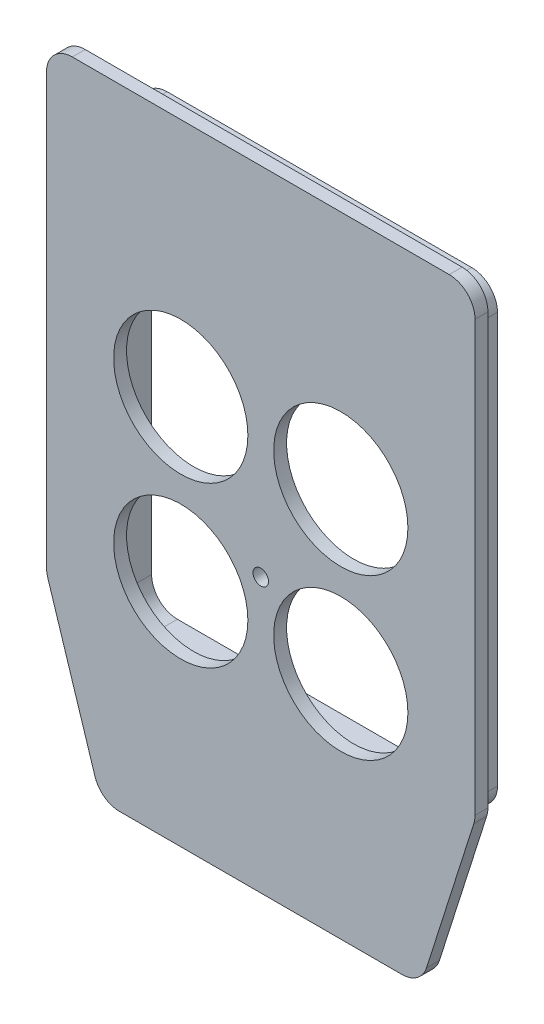
ISO-10303-21;
HEADER;
FILE_DESCRIPTION(('STEP AP214'),'2;1');
FILE_NAME('part.step','',(''),(''),'','','');
FILE_SCHEMA(('AUTOMOTIVE_DESIGN { 1 0 10303 214 1 1 1 1 }'));
ENDSEC;
DATA;
#1=APPLICATION_CONTEXT('core data for automotive mechanical design processes');
#2=APPLICATION_PROTOCOL_DEFINITION('international standard','automotive_design',2000,#1);
#3=PRODUCT_CONTEXT('',#1,'mechanical');
#4=PRODUCT('Part','Part','',(#3));
#5=PRODUCT_RELATED_PRODUCT_CATEGORY('part','',(#4));
#6=PRODUCT_DEFINITION_FORMATION('','',#4);
#7=PRODUCT_DEFINITION_CONTEXT('part definition',#1,'design');
#8=PRODUCT_DEFINITION('design','',#6,#7);
#9=PRODUCT_DEFINITION_SHAPE('','',#8);
#10=(LENGTH_UNIT() NAMED_UNIT(*) SI_UNIT(.MILLI.,.METRE.));
#11=(NAMED_UNIT(*) PLANE_ANGLE_UNIT() SI_UNIT($,.RADIAN.));
#12=(NAMED_UNIT(*) SI_UNIT($,.STERADIAN.) SOLID_ANGLE_UNIT());
#13=UNCERTAINTY_MEASURE_WITH_UNIT(LENGTH_MEASURE(1.E-05),#10,'distance_accuracy_value','');
#14=(GEOMETRIC_REPRESENTATION_CONTEXT(3) GLOBAL_UNCERTAINTY_ASSIGNED_CONTEXT((#13)) GLOBAL_UNIT_ASSIGNED_CONTEXT((#10,
#11,#12)) REPRESENTATION_CONTEXT('',''));
#15=CARTESIAN_POINT('',(0.,0.,0.));
#16=DIRECTION('',(0.,0.,1.));
#17=DIRECTION('',(1.,0.,0.));
#18=AXIS2_PLACEMENT_3D('',#15,#16,#17);
#19=CARTESIAN_POINT('',(0.,0.,0.));
#20=DIRECTION('',(0.,0.,-1.));
#21=DIRECTION('',(-1.,0.,0.));
#22=AXIS2_PLACEMENT_3D('',#19,#20,#21);
#23=PLANE('',#22);
#24=DIRECTION('',(-1.,0.,0.));
#25=VECTOR('',#24,1.);
#26=CARTESIAN_POINT('',(0.,81.,0.));
#27=LINE('',#26,#25);
#28=CARTESIAN_POINT('',(71.,81.,0.));
#29=VERTEX_POINT('',#28);
#30=CARTESIAN_POINT('',(12.,81.,0.));
#31=VERTEX_POINT('',#30);
#32=EDGE_CURVE('E562',#29,#31,#27,.T.);
#33=ORIENTED_EDGE('',*,*,#32,.T.);
#34=CARTESIAN_POINT('',(12.,76.,0.));
#35=DIRECTION('',(0.,0.,-1.));
#36=DIRECTION('',(-1.,0.,0.));
#37=AXIS2_PLACEMENT_3D('',#34,#35,#36);
#38=CIRCLE('',#37,5.);
#39=CARTESIAN_POINT('',(7.00000000000002,76.,0.));
#40=VERTEX_POINT('',#39);
#41=EDGE_CURVE('E376',#31,#40,#38,.F.);
#42=ORIENTED_EDGE('',*,*,#41,.T.);
#43=DIRECTION('',(0.,-1.,0.));
#44=VECTOR('',#43,1.);
#45=CARTESIAN_POINT('',(7.00000000000001,0.,0.));
#46=LINE('',#45,#44);
#47=CARTESIAN_POINT('',(7.00000000000001,-3.5,0.));
#48=VERTEX_POINT('',#47);
#49=EDGE_CURVE('E559',#40,#48,#46,.T.);
#50=ORIENTED_EDGE('',*,*,#49,.T.);
#51=CARTESIAN_POINT('',(12.,-3.5,0.));
#52=DIRECTION('',(0.,0.,-1.));
#53=DIRECTION('',(-1.,0.,0.));
#54=AXIS2_PLACEMENT_3D('',#51,#52,#53);
#55=CIRCLE('',#54,5.);
#56=CARTESIAN_POINT('',(12.,-8.5,0.));
#57=VERTEX_POINT('',#56);
#58=EDGE_CURVE('E366',#48,#57,#55,.F.);
#59=ORIENTED_EDGE('',*,*,#58,.T.);
#60=DIRECTION('',(-1.,0.,0.));
#61=VECTOR('',#60,1.);
#62=CARTESIAN_POINT('',(0.,-8.5,0.));
#63=LINE('',#62,#61);
#64=CARTESIAN_POINT('',(71.,-8.5,0.));
#65=VERTEX_POINT('',#64);
#66=EDGE_CURVE('E567',#65,#57,#63,.T.);
#67=ORIENTED_EDGE('',*,*,#66,.F.);
#68=CARTESIAN_POINT('',(71.,-3.5,0.));
#69=DIRECTION('',(0.,0.,-1.));
#70=DIRECTION('',(-1.,0.,0.));
#71=AXIS2_PLACEMENT_3D('',#68,#69,#70);
#72=CIRCLE('',#71,5.);
#73=CARTESIAN_POINT('',(76.,-3.5,0.));
#74=VERTEX_POINT('',#73);
#75=EDGE_CURVE('E368',#65,#74,#72,.F.);
#76=ORIENTED_EDGE('',*,*,#75,.T.);
#77=DIRECTION('',(0.,-1.,0.));
#78=VECTOR('',#77,1.);
#79=CARTESIAN_POINT('',(76.,0.,0.));
#80=LINE('',#79,#78);
#81=CARTESIAN_POINT('',(76.,76.,0.));
#82=VERTEX_POINT('',#81);
#83=EDGE_CURVE('E564',#82,#74,#80,.T.);
#84=ORIENTED_EDGE('',*,*,#83,.F.);
#85=CARTESIAN_POINT('',(71.,76.,0.));
#86=DIRECTION('',(0.,0.,-1.));
#87=DIRECTION('',(-1.,0.,0.));
#88=AXIS2_PLACEMENT_3D('',#85,#86,#87);
#89=CIRCLE('',#88,5.);
#90=EDGE_CURVE('E11',#82,#29,#89,.F.);
#91=ORIENTED_EDGE('',*,*,#90,.T.);
#92=EDGE_LOOP('',(#33,#42,#50,#59,#67,#76,#84,#91));
#93=FACE_BOUND('',#92,.T.);
#94=DIRECTION('',(0.,-1.,0.));
#95=VECTOR('',#94,1.);
#96=CARTESIAN_POINT('',(0.,0.,0.));
#97=LINE('',#96,#95);
#98=CARTESIAN_POINT('',(0.,84.,0.));
#99=VERTEX_POINT('',#98);
#100=CARTESIAN_POINT('',(0.,0.776280543735993,0.));
#101=VERTEX_POINT('',#100);
#102=EDGE_CURVE('E238',#99,#101,#97,.T.);
#103=ORIENTED_EDGE('',*,*,#102,.F.);
#104=CARTESIAN_POINT('',(4.99999999999999,84.,0.));
#105=DIRECTION('',(0.,0.,-1.));
#106=DIRECTION('',(-1.,0.,0.));
#107=AXIS2_PLACEMENT_3D('',#104,#105,#106);
#108=CIRCLE('',#107,5.);
#109=CARTESIAN_POINT('',(4.99999999999999,89.,0.));
#110=VERTEX_POINT('',#109);
#111=EDGE_CURVE('E221',#99,#110,#108,.T.);
#112=ORIENTED_EDGE('',*,*,#111,.T.);
#113=DIRECTION('',(-1.,0.,0.));
#114=VECTOR('',#113,1.);
#115=CARTESIAN_POINT('',(0.,89.,0.));
#116=LINE('',#115,#114);
#117=CARTESIAN_POINT('',(78.,89.,0.));
#118=VERTEX_POINT('',#117);
#119=EDGE_CURVE('E267',#118,#110,#116,.T.);
#120=ORIENTED_EDGE('',*,*,#119,.F.);
#121=CARTESIAN_POINT('',(78.,84.,0.));
#122=DIRECTION('',(0.,0.,-1.));
#123=DIRECTION('',(-1.,0.,0.));
#124=AXIS2_PLACEMENT_3D('',#121,#122,#123);
#125=CIRCLE('',#124,5.);
#126=CARTESIAN_POINT('',(83.,84.,0.));
#127=VERTEX_POINT('',#126);
#128=EDGE_CURVE('E232',#118,#127,#125,.T.);
#129=ORIENTED_EDGE('',*,*,#128,.T.);
#130=DIRECTION('',(0.,1.,0.));
#131=VECTOR('',#130,1.);
#132=CARTESIAN_POINT('',(83.,0.,0.));
#133=LINE('',#132,#131);
#134=CARTESIAN_POINT('',(83.,0.776280543735969,0.));
#135=VERTEX_POINT('',#134);
#136=EDGE_CURVE('E264',#135,#127,#133,.T.);
#137=ORIENTED_EDGE('',*,*,#136,.F.);
#138=CARTESIAN_POINT('',(78.,0.776280543735968,0.));
#139=DIRECTION('',(0.,0.,-1.));
#140=DIRECTION('',(-1.,0.,0.));
#141=AXIS2_PLACEMENT_3D('',#138,#139,#140);
#142=CIRCLE('',#141,5.);
#143=CARTESIAN_POINT('',(82.7646289000663,-0.739737742648773,0.));
#144=VERTEX_POINT('',#143);
#145=EDGE_CURVE('E275',#135,#144,#142,.T.);
#146=ORIENTED_EDGE('',*,*,#145,.T.);
#147=DIRECTION('',(0.303203657276947,0.952925780013262,0.));
#148=VECTOR('',#147,1.);
#149=CARTESIAN_POINT('',(72.5,-33.,0.));
#150=LINE('',#149,#148);
#151=CARTESIAN_POINT('',(73.6085396361503,-29.5160182863847,0.));
#152=VERTEX_POINT('',#151);
#153=EDGE_CURVE('E261',#152,#144,#150,.T.);
#154=ORIENTED_EDGE('',*,*,#153,.F.);
#155=CARTESIAN_POINT('',(68.843910736084,-28.,0.));
#156=DIRECTION('',(0.,0.,-1.));
#157=DIRECTION('',(-1.,0.,0.));
#158=AXIS2_PLACEMENT_3D('',#155,#156,#157);
#159=CIRCLE('',#158,5.);
#160=CARTESIAN_POINT('',(68.843910736084,-33.,0.));
#161=VERTEX_POINT('',#160);
#162=EDGE_CURVE('E273',#152,#161,#159,.T.);
#163=ORIENTED_EDGE('',*,*,#162,.T.);
#164=DIRECTION('',(1.,0.,0.));
#165=VECTOR('',#164,1.);
#166=CARTESIAN_POINT('',(10.5,-33.,0.));
#167=LINE('',#166,#165);
#168=CARTESIAN_POINT('',(14.156089263916,-33.,0.));
#169=VERTEX_POINT('',#168);
#170=EDGE_CURVE('E250',#169,#161,#167,.T.);
#171=ORIENTED_EDGE('',*,*,#170,.F.);
#172=CARTESIAN_POINT('',(14.156089263916,-28.,0.));
#173=DIRECTION('',(0.,0.,-1.));
#174=DIRECTION('',(-1.,0.,0.));
#175=AXIS2_PLACEMENT_3D('',#172,#173,#174);
#176=CIRCLE('',#175,5.);
#177=CARTESIAN_POINT('',(9.39146036384969,-29.5160182863847,0.));
#178=VERTEX_POINT('',#177);
#179=EDGE_CURVE('E271',#169,#178,#176,.T.);
#180=ORIENTED_EDGE('',*,*,#179,.T.);
#181=DIRECTION('',(0.303203657276947,-0.952925780013262,0.));
#182=VECTOR('',#181,1.);
#183=CARTESIAN_POINT('',(0.,0.,0.));
#184=LINE('',#183,#182);
#185=CARTESIAN_POINT('',(0.23537109993369,-0.739737742648741,0.));
#186=VERTEX_POINT('',#185);
#187=EDGE_CURVE('E246',#186,#178,#184,.T.);
#188=ORIENTED_EDGE('',*,*,#187,.F.);
#189=CARTESIAN_POINT('',(5.,0.776280543735994,0.));
#190=DIRECTION('',(0.,0.,-1.));
#191=DIRECTION('',(-1.,0.,0.));
#192=AXIS2_PLACEMENT_3D('',#189,#190,#191);
#193=CIRCLE('',#192,5.);
#194=EDGE_CURVE('E242',#186,#101,#193,.T.);
#195=ORIENTED_EDGE('',*,*,#194,.T.);
#196=EDGE_LOOP('',(#103,#112,#120,#129,#137,#146,#154,#163,#171,#180,#188,#195));
#197=FACE_BOUND('',#196,.T.);
#198=ADVANCED_FACE('F35',(#93,#197),#23,.T.);
#199=CARTESIAN_POINT('',(0.,0.,2.5));
#200=DIRECTION('',(0.,0.,-1.));
#201=DIRECTION('',(-1.,0.,0.));
#202=AXIS2_PLACEMENT_3D('',#199,#200,#201);
#203=PLANE('',#202);
#204=DIRECTION('',(-1.,0.,0.));
#205=VECTOR('',#204,1.);
#206=CARTESIAN_POINT('',(0.,89.,2.5));
#207=LINE('',#206,#205);
#208=CARTESIAN_POINT('',(78.,89.,2.5));
#209=VERTEX_POINT('',#208);
#210=CARTESIAN_POINT('',(4.99999999999999,89.,2.5));
#211=VERTEX_POINT('',#210);
#212=EDGE_CURVE('E256',#209,#211,#207,.T.);
#213=ORIENTED_EDGE('',*,*,#212,.T.);
#214=CARTESIAN_POINT('',(4.99999999999999,84.,2.5));
#215=DIRECTION('',(0.,0.,-1.));
#216=DIRECTION('',(-1.,0.,0.));
#217=AXIS2_PLACEMENT_3D('',#214,#215,#216);
#218=CIRCLE('',#217,5.);
#219=CARTESIAN_POINT('',(0.,84.,2.5));
#220=VERTEX_POINT('',#219);
#221=EDGE_CURVE('E291',#211,#220,#218,.F.);
#222=ORIENTED_EDGE('',*,*,#221,.T.);
#223=DIRECTION('',(0.,-1.,0.));
#224=VECTOR('',#223,1.);
#225=CARTESIAN_POINT('',(0.,0.,2.5));
#226=LINE('',#225,#224);
#227=CARTESIAN_POINT('',(0.,0.776280543735993,2.5));
#228=VERTEX_POINT('',#227);
#229=EDGE_CURVE('E241',#220,#228,#226,.T.);
#230=ORIENTED_EDGE('',*,*,#229,.T.);
#231=CARTESIAN_POINT('',(5.,0.776280543735994,2.5));
#232=DIRECTION('',(0.,0.,-1.));
#233=DIRECTION('',(-1.,0.,0.));
#234=AXIS2_PLACEMENT_3D('',#231,#232,#233);
#235=CIRCLE('',#234,5.);
#236=CARTESIAN_POINT('',(0.23537109993369,-0.739737742648741,2.5));
#237=VERTEX_POINT('',#236);
#238=EDGE_CURVE('E281',#228,#237,#235,.F.);
#239=ORIENTED_EDGE('',*,*,#238,.T.);
#240=DIRECTION('',(0.303203657276947,-0.952925780013262,0.));
#241=VECTOR('',#240,1.);
#242=CARTESIAN_POINT('',(0.,0.,2.5));
#243=LINE('',#242,#241);
#244=CARTESIAN_POINT('',(9.39146036384969,-29.5160182863847,2.5));
#245=VERTEX_POINT('',#244);
#246=EDGE_CURVE('E467',#237,#245,#243,.T.);
#247=ORIENTED_EDGE('',*,*,#246,.T.);
#248=CARTESIAN_POINT('',(14.156089263916,-28.,2.5));
#249=DIRECTION('',(0.,0.,-1.));
#250=DIRECTION('',(-1.,0.,0.));
#251=AXIS2_PLACEMENT_3D('',#248,#249,#250);
#252=CIRCLE('',#251,5.);
#253=CARTESIAN_POINT('',(14.156089263916,-33.,2.5));
#254=VERTEX_POINT('',#253);
#255=EDGE_CURVE('E283',#245,#254,#252,.F.);
#256=ORIENTED_EDGE('',*,*,#255,.T.);
#257=DIRECTION('',(1.,0.,0.));
#258=VECTOR('',#257,1.);
#259=CARTESIAN_POINT('',(10.5,-33.,2.5));
#260=LINE('',#259,#258);
#261=CARTESIAN_POINT('',(68.843910736084,-33.,2.5));
#262=VERTEX_POINT('',#261);
#263=EDGE_CURVE('E470',#254,#262,#260,.T.);
#264=ORIENTED_EDGE('',*,*,#263,.T.);
#265=CARTESIAN_POINT('',(68.843910736084,-28.,2.5));
#266=DIRECTION('',(0.,0.,-1.));
#267=DIRECTION('',(-1.,0.,0.));
#268=AXIS2_PLACEMENT_3D('',#265,#266,#267);
#269=CIRCLE('',#268,5.);
#270=CARTESIAN_POINT('',(73.6085396361503,-29.5160182863847,2.5));
#271=VERTEX_POINT('',#270);
#272=EDGE_CURVE('E285',#262,#271,#269,.F.);
#273=ORIENTED_EDGE('',*,*,#272,.T.);
#274=DIRECTION('',(0.303203657276947,0.952925780013262,0.));
#275=VECTOR('',#274,1.);
#276=CARTESIAN_POINT('',(72.5,-33.,2.5));
#277=LINE('',#276,#275);
#278=CARTESIAN_POINT('',(82.7646289000663,-0.739737742648773,2.5));
#279=VERTEX_POINT('',#278);
#280=EDGE_CURVE('E473',#271,#279,#277,.T.);
#281=ORIENTED_EDGE('',*,*,#280,.T.);
#282=CARTESIAN_POINT('',(78.,0.776280543735968,2.5));
#283=DIRECTION('',(0.,0.,-1.));
#284=DIRECTION('',(-1.,0.,0.));
#285=AXIS2_PLACEMENT_3D('',#282,#283,#284);
#286=CIRCLE('',#285,5.);
#287=CARTESIAN_POINT('',(83.,0.776280543735969,2.5));
#288=VERTEX_POINT('',#287);
#289=EDGE_CURVE('E287',#279,#288,#286,.F.);
#290=ORIENTED_EDGE('',*,*,#289,.T.);
#291=DIRECTION('',(0.,1.,0.));
#292=VECTOR('',#291,1.);
#293=CARTESIAN_POINT('',(83.,0.,2.5));
#294=LINE('',#293,#292);
#295=CARTESIAN_POINT('',(83.,84.,2.5));
#296=VERTEX_POINT('',#295);
#297=EDGE_CURVE('E475',#288,#296,#294,.T.);
#298=ORIENTED_EDGE('',*,*,#297,.T.);
#299=CARTESIAN_POINT('',(78.,84.,2.5));
#300=DIRECTION('',(0.,0.,-1.));
#301=DIRECTION('',(-1.,0.,0.));
#302=AXIS2_PLACEMENT_3D('',#299,#300,#301);
#303=CIRCLE('',#302,5.);
#304=EDGE_CURVE('E289',#296,#209,#303,.F.);
#305=ORIENTED_EDGE('',*,*,#304,.T.);
#306=EDGE_LOOP('',(#213,#222,#230,#239,#247,#256,#264,#273,#281,#290,#298,#305));
#307=FACE_BOUND('',#306,.T.);
#308=CARTESIAN_POINT('',(57.,42.5,2.5));
#309=DIRECTION('',(0.,0.,1.));
#310=DIRECTION('',(1.,0.,0.));
#311=AXIS2_PLACEMENT_3D('',#308,#309,#310);
#312=CIRCLE('',#311,13.);
#313=CARTESIAN_POINT('',(70.,42.5,2.5));
#314=VERTEX_POINT('',#313);
#315=EDGE_CURVE('E247',#314,#314,#312,.T.);
#316=ORIENTED_EDGE('',*,*,#315,.F.);
#317=EDGE_LOOP('',(#316));
#318=FACE_BOUND('',#317,.T.);
#319=CARTESIAN_POINT('',(26.,11.5,2.5));
#320=DIRECTION('',(0.,0.,1.));
#321=DIRECTION('',(1.,0.,0.));
#322=AXIS2_PLACEMENT_3D('',#319,#320,#321);
#323=CIRCLE('',#322,13.);
#324=CARTESIAN_POINT('',(39.,11.5,2.5));
#325=VERTEX_POINT('',#324);
#326=EDGE_CURVE('E461',#325,#325,#323,.T.);
#327=ORIENTED_EDGE('',*,*,#326,.F.);
#328=EDGE_LOOP('',(#327));
#329=FACE_BOUND('',#328,.T.);
#330=CARTESIAN_POINT('',(26.,42.5,2.5));
#331=DIRECTION('',(0.,0.,1.));
#332=DIRECTION('',(1.,0.,0.));
#333=AXIS2_PLACEMENT_3D('',#330,#331,#332);
#334=CIRCLE('',#333,13.);
#335=CARTESIAN_POINT('',(39.,42.5,2.5));
#336=VERTEX_POINT('',#335);
#337=EDGE_CURVE('E457',#336,#336,#334,.T.);
#338=ORIENTED_EDGE('',*,*,#337,.F.);
#339=EDGE_LOOP('',(#338));
#340=FACE_BOUND('',#339,.T.);
#341=CARTESIAN_POINT('',(57.,11.5,2.5));
#342=DIRECTION('',(0.,0.,1.));
#343=DIRECTION('',(1.,0.,0.));
#344=AXIS2_PLACEMENT_3D('',#341,#342,#343);
#345=CIRCLE('',#344,13.);
#346=CARTESIAN_POINT('',(70.,11.5,2.5));
#347=VERTEX_POINT('',#346);
#348=EDGE_CURVE('E453',#347,#347,#345,.T.);
#349=ORIENTED_EDGE('',*,*,#348,.F.);
#350=EDGE_LOOP('',(#349));
#351=FACE_BOUND('',#350,.T.);
#352=CARTESIAN_POINT('',(41.5,19.99,2.5));
#353=DIRECTION('',(0.,0.,1.));
#354=DIRECTION('',(1.,0.,0.));
#355=AXIS2_PLACEMENT_3D('',#352,#353,#354);
#356=CIRCLE('',#355,1.5);
#357=CARTESIAN_POINT('',(43.,19.99,2.5));
#358=VERTEX_POINT('',#357);
#359=EDGE_CURVE('E444',#358,#358,#356,.T.);
#360=ORIENTED_EDGE('',*,*,#359,.F.);
#361=EDGE_LOOP('',(#360));
#362=FACE_BOUND('',#361,.T.);
#363=ADVANCED_FACE('F404',(#307,#318,#329,#340,#351,#362),#203,.F.);
#364=DIRECTION('',(0.,-1.,0.));
#365=VECTOR('',#364,1.);
#366=CARTESIAN_POINT('',(74.,0.,0.));
#367=LINE('',#366,#365);
#368=CARTESIAN_POINT('',(74.,74.,0.));
#369=VERTEX_POINT('',#368);
#370=CARTESIAN_POINT('',(74.,-1.5,0.));
#371=VERTEX_POINT('',#370);
#372=EDGE_CURVE('E424',#369,#371,#367,.T.);
#373=ORIENTED_EDGE('',*,*,#372,.T.);
#374=CARTESIAN_POINT('',(69.,-1.5,0.));
#375=DIRECTION('',(0.,0.,-1.));
#376=DIRECTION('',(-1.,0.,0.));
#377=AXIS2_PLACEMENT_3D('',#374,#375,#376);
#378=CIRCLE('',#377,5.);
#379=CARTESIAN_POINT('',(69.,-6.5,0.));
#380=VERTEX_POINT('',#379);
#381=EDGE_CURVE('E345',#371,#380,#378,.T.);
#382=ORIENTED_EDGE('',*,*,#381,.T.);
#383=DIRECTION('',(-1.,0.,0.));
#384=VECTOR('',#383,1.);
#385=CARTESIAN_POINT('',(0.,-6.50000000000001,0.));
#386=LINE('',#385,#384);
#387=CARTESIAN_POINT('',(14.,-6.50000000000001,0.));
#388=VERTEX_POINT('',#387);
#389=EDGE_CURVE('E574',#380,#388,#386,.T.);
#390=ORIENTED_EDGE('',*,*,#389,.T.);
#391=CARTESIAN_POINT('',(14.,-1.50000000000001,0.));
#392=DIRECTION('',(0.,0.,-1.));
#393=DIRECTION('',(-1.,0.,0.));
#394=AXIS2_PLACEMENT_3D('',#391,#392,#393);
#395=CIRCLE('',#394,5.);
#396=CARTESIAN_POINT('',(9.00000000000002,-1.50000000000001,0.));
#397=VERTEX_POINT('',#396);
#398=EDGE_CURVE('E343',#388,#397,#395,.T.);
#399=ORIENTED_EDGE('',*,*,#398,.T.);
#400=DIRECTION('',(0.,-1.,0.));
#401=VECTOR('',#400,1.);
#402=CARTESIAN_POINT('',(9.00000000000002,0.,0.));
#403=LINE('',#402,#401);
#404=CARTESIAN_POINT('',(9.00000000000002,74.,0.));
#405=VERTEX_POINT('',#404);
#406=EDGE_CURVE('E573',#405,#397,#403,.T.);
#407=ORIENTED_EDGE('',*,*,#406,.F.);
#408=CARTESIAN_POINT('',(14.,74.,0.));
#409=DIRECTION('',(0.,0.,-1.));
#410=DIRECTION('',(-1.,0.,0.));
#411=AXIS2_PLACEMENT_3D('',#408,#409,#410);
#412=CIRCLE('',#411,5.);
#413=CARTESIAN_POINT('',(14.,79.,0.));
#414=VERTEX_POINT('',#413);
#415=EDGE_CURVE('E50',#405,#414,#412,.T.);
#416=ORIENTED_EDGE('',*,*,#415,.T.);
#417=DIRECTION('',(-1.,0.,0.));
#418=VECTOR('',#417,1.);
#419=CARTESIAN_POINT('',(0.,79.,0.));
#420=LINE('',#419,#418);
#421=CARTESIAN_POINT('',(69.,79.,0.));
#422=VERTEX_POINT('',#421);
#423=EDGE_CURVE('E571',#422,#414,#420,.T.);
#424=ORIENTED_EDGE('',*,*,#423,.F.);
#425=CARTESIAN_POINT('',(69.,74.,0.));
#426=DIRECTION('',(0.,0.,-1.));
#427=DIRECTION('',(-1.,0.,0.));
#428=AXIS2_PLACEMENT_3D('',#425,#426,#427);
#429=CIRCLE('',#428,5.);
#430=EDGE_CURVE('E58',#422,#369,#429,.T.);
#431=ORIENTED_EDGE('',*,*,#430,.T.);
#432=EDGE_LOOP('',(#373,#382,#390,#399,#407,#416,#424,#431));
#433=FACE_BOUND('',#432,.T.);
#434=CARTESIAN_POINT('',(57.,11.5,0.));
#435=DIRECTION('',(0.,0.,1.));
#436=DIRECTION('',(1.,0.,0.));
#437=AXIS2_PLACEMENT_3D('',#434,#435,#436);
#438=CIRCLE('',#437,13.);
#439=CARTESIAN_POINT('',(70.,11.5,0.));
#440=VERTEX_POINT('',#439);
#441=EDGE_CURVE('E428',#440,#440,#438,.T.);
#442=ORIENTED_EDGE('',*,*,#441,.T.);
#443=EDGE_LOOP('',(#442));
#444=FACE_BOUND('',#443,.T.);
#445=CARTESIAN_POINT('',(26.,11.5,0.));
#446=DIRECTION('',(0.,0.,1.));
#447=DIRECTION('',(1.,0.,0.));
#448=AXIS2_PLACEMENT_3D('',#445,#446,#447);
#449=CIRCLE('',#448,13.);
#450=CARTESIAN_POINT('',(39.,11.5,0.));
#451=VERTEX_POINT('',#450);
#452=EDGE_CURVE('E432',#451,#451,#449,.T.);
#453=ORIENTED_EDGE('',*,*,#452,.T.);
#454=EDGE_LOOP('',(#453));
#455=FACE_BOUND('',#454,.T.);
#456=CARTESIAN_POINT('',(57.,42.5,0.));
#457=DIRECTION('',(0.,0.,1.));
#458=DIRECTION('',(1.,0.,0.));
#459=AXIS2_PLACEMENT_3D('',#456,#457,#458);
#460=CIRCLE('',#459,13.);
#461=CARTESIAN_POINT('',(70.,42.5,0.));
#462=VERTEX_POINT('',#461);
#463=EDGE_CURVE('E253',#462,#462,#460,.T.);
#464=ORIENTED_EDGE('',*,*,#463,.T.);
#465=EDGE_LOOP('',(#464));
#466=FACE_BOUND('',#465,.T.);
#467=CARTESIAN_POINT('',(26.,42.5,0.));
#468=DIRECTION('',(0.,0.,1.));
#469=DIRECTION('',(1.,0.,0.));
#470=AXIS2_PLACEMENT_3D('',#467,#468,#469);
#471=CIRCLE('',#470,13.);
#472=CARTESIAN_POINT('',(39.,42.5,0.));
#473=VERTEX_POINT('',#472);
#474=EDGE_CURVE('E439',#473,#473,#471,.T.);
#475=ORIENTED_EDGE('',*,*,#474,.T.);
#476=EDGE_LOOP('',(#475));
#477=FACE_BOUND('',#476,.T.);
#478=CARTESIAN_POINT('',(41.5,19.99,0.));
#479=DIRECTION('',(0.,0.,1.));
#480=DIRECTION('',(1.,0.,0.));
#481=AXIS2_PLACEMENT_3D('',#478,#479,#480);
#482=CIRCLE('',#481,1.5);
#483=CARTESIAN_POINT('',(43.,19.99,0.));
#484=VERTEX_POINT('',#483);
#485=EDGE_CURVE('E442',#484,#484,#482,.T.);
#486=ORIENTED_EDGE('',*,*,#485,.T.);
#487=EDGE_LOOP('',(#486));
#488=FACE_BOUND('',#487,.T.);
#489=ADVANCED_FACE('F407',(#433,#444,#455,#466,#477,#488),#23,.T.);
#490=CARTESIAN_POINT('',(0.,0.,2.5));
#491=DIRECTION('',(1.,0.,0.));
#492=DIRECTION('',(0.,1.,0.));
#493=AXIS2_PLACEMENT_3D('',#490,#491,#492);
#494=PLANE('',#493);
#495=ORIENTED_EDGE('',*,*,#229,.F.);
#496=DIRECTION('',(0.,0.,-1.));
#497=VECTOR('',#496,1.);
#498=CARTESIAN_POINT('',(0.,84.,2.5));
#499=LINE('',#498,#497);
#500=EDGE_CURVE('E225',#220,#99,#499,.T.);
#501=ORIENTED_EDGE('',*,*,#500,.T.);
#502=ORIENTED_EDGE('',*,*,#102,.T.);
#503=DIRECTION('',(0.,0.,-1.));
#504=VECTOR('',#503,1.);
#505=CARTESIAN_POINT('',(0.,0.776280543735993,2.5));
#506=LINE('',#505,#504);
#507=EDGE_CURVE('E243',#101,#228,#506,.F.);
#508=ORIENTED_EDGE('',*,*,#507,.T.);
#509=EDGE_LOOP('',(#495,#501,#502,#508));
#510=FACE_BOUND('',#509,.T.);
#511=ADVANCED_FACE('F237',(#510),#494,.F.);
#512=CARTESIAN_POINT('',(0.,0.,2.5));
#513=DIRECTION('',(0.952925780013262,0.303203657276947,0.));
#514=DIRECTION('',(-0.303203657276947,0.952925780013262,0.));
#515=AXIS2_PLACEMENT_3D('',#512,#513,#514);
#516=PLANE('',#515);
#517=ORIENTED_EDGE('',*,*,#187,.T.);
#518=DIRECTION('',(0.,0.,-1.));
#519=VECTOR('',#518,1.);
#520=CARTESIAN_POINT('',(9.39146036384969,-29.5160182863847,2.5));
#521=LINE('',#520,#519);
#522=EDGE_CURVE('E311',#178,#245,#521,.F.);
#523=ORIENTED_EDGE('',*,*,#522,.T.);
#524=ORIENTED_EDGE('',*,*,#246,.F.);
#525=DIRECTION('',(0.,0.,-1.));
#526=VECTOR('',#525,1.);
#527=CARTESIAN_POINT('',(0.23537109993369,-0.739737742648741,2.5));
#528=LINE('',#527,#526);
#529=EDGE_CURVE('E308',#237,#186,#528,.T.);
#530=ORIENTED_EDGE('',*,*,#529,.T.);
#531=EDGE_LOOP('',(#517,#523,#524,#530));
#532=FACE_BOUND('',#531,.T.);
#533=ADVANCED_FACE('F419',(#532),#516,.F.);
#534=CARTESIAN_POINT('',(10.5,-33.,2.5));
#535=DIRECTION('',(0.,1.,0.));
#536=DIRECTION('',(0.,0.,1.));
#537=AXIS2_PLACEMENT_3D('',#534,#535,#536);
#538=PLANE('',#537);
#539=ORIENTED_EDGE('',*,*,#170,.T.);
#540=DIRECTION('',(0.,0.,-1.));
#541=VECTOR('',#540,1.);
#542=CARTESIAN_POINT('',(68.843910736084,-33.,2.5));
#543=LINE('',#542,#541);
#544=EDGE_CURVE('E306',#161,#262,#543,.F.);
#545=ORIENTED_EDGE('',*,*,#544,.T.);
#546=ORIENTED_EDGE('',*,*,#263,.F.);
#547=DIRECTION('',(0.,0.,-1.));
#548=VECTOR('',#547,1.);
#549=CARTESIAN_POINT('',(14.156089263916,-33.,2.5));
#550=LINE('',#549,#548);
#551=EDGE_CURVE('E303',#254,#169,#550,.T.);
#552=ORIENTED_EDGE('',*,*,#551,.T.);
#553=EDGE_LOOP('',(#539,#545,#546,#552));
#554=FACE_BOUND('',#553,.T.);
#555=ADVANCED_FACE('F507',(#554),#538,.F.);
#556=CARTESIAN_POINT('',(72.5,-33.,2.5));
#557=DIRECTION('',(-0.952925780013262,0.303203657276947,0.));
#558=DIRECTION('',(-0.303203657276947,-0.952925780013262,0.));
#559=AXIS2_PLACEMENT_3D('',#556,#557,#558);
#560=PLANE('',#559);
#561=ORIENTED_EDGE('',*,*,#153,.T.);
#562=DIRECTION('',(0.,0.,-1.));
#563=VECTOR('',#562,1.);
#564=CARTESIAN_POINT('',(82.7646289000663,-0.739737742648766,2.5));
#565=LINE('',#564,#563);
#566=EDGE_CURVE('E301',#144,#279,#565,.F.);
#567=ORIENTED_EDGE('',*,*,#566,.T.);
#568=ORIENTED_EDGE('',*,*,#280,.F.);
#569=DIRECTION('',(0.,0.,-1.));
#570=VECTOR('',#569,1.);
#571=CARTESIAN_POINT('',(73.6085396361503,-29.5160182863847,2.5));
#572=LINE('',#571,#570);
#573=EDGE_CURVE('E298',#271,#152,#572,.T.);
#574=ORIENTED_EDGE('',*,*,#573,.T.);
#575=EDGE_LOOP('',(#561,#567,#568,#574));
#576=FACE_BOUND('',#575,.T.);
#577=ADVANCED_FACE('F498',(#576),#560,.F.);
#578=CARTESIAN_POINT('',(83.,0.,2.5));
#579=DIRECTION('',(-1.,0.,0.));
#580=DIRECTION('',(0.,-1.,0.));
#581=AXIS2_PLACEMENT_3D('',#578,#579,#580);
#582=PLANE('',#581);
#583=ORIENTED_EDGE('',*,*,#136,.T.);
#584=DIRECTION('',(0.,0.,-1.));
#585=VECTOR('',#584,1.);
#586=CARTESIAN_POINT('',(83.,84.,2.5));
#587=LINE('',#586,#585);
#588=EDGE_CURVE('E296',#127,#296,#587,.F.);
#589=ORIENTED_EDGE('',*,*,#588,.T.);
#590=ORIENTED_EDGE('',*,*,#297,.F.);
#591=DIRECTION('',(0.,0.,-1.));
#592=VECTOR('',#591,1.);
#593=CARTESIAN_POINT('',(83.,0.776280543735969,2.5));
#594=LINE('',#593,#592);
#595=EDGE_CURVE('E293',#288,#135,#594,.T.);
#596=ORIENTED_EDGE('',*,*,#595,.T.);
#597=EDGE_LOOP('',(#583,#589,#590,#596));
#598=FACE_BOUND('',#597,.T.);
#599=ADVANCED_FACE('F490',(#598),#582,.F.);
#600=CARTESIAN_POINT('',(0.,89.,2.5));
#601=DIRECTION('',(0.,-1.,0.));
#602=DIRECTION('',(0.,0.,-1.));
#603=AXIS2_PLACEMENT_3D('',#600,#601,#602);
#604=PLANE('',#603);
#605=ORIENTED_EDGE('',*,*,#119,.T.);
#606=DIRECTION('',(0.,0.,-1.));
#607=VECTOR('',#606,1.);
#608=CARTESIAN_POINT('',(4.99999999999999,89.,2.5));
#609=LINE('',#608,#607);
#610=EDGE_CURVE('E226',#110,#211,#609,.F.);
#611=ORIENTED_EDGE('',*,*,#610,.T.);
#612=ORIENTED_EDGE('',*,*,#212,.F.);
#613=DIRECTION('',(0.,0.,-1.));
#614=VECTOR('',#613,1.);
#615=CARTESIAN_POINT('',(78.,89.,2.5));
#616=LINE('',#615,#614);
#617=EDGE_CURVE('E231',#209,#118,#616,.T.);
#618=ORIENTED_EDGE('',*,*,#617,.T.);
#619=EDGE_LOOP('',(#605,#611,#612,#618));
#620=FACE_BOUND('',#619,.T.);
#621=ADVANCED_FACE('F484',(#620),#604,.F.);
#622=CARTESIAN_POINT('',(57.,42.5,2.5));
#623=DIRECTION('',(0.,0.,-1.));
#624=DIRECTION('',(-1.,0.,0.));
#625=AXIS2_PLACEMENT_3D('',#622,#623,#624);
#626=CYLINDRICAL_SURFACE('',#625,13.);
#627=ORIENTED_EDGE('',*,*,#315,.T.);
#628=EDGE_LOOP('',(#627));
#629=FACE_BOUND('',#628,.T.);
#630=ORIENTED_EDGE('',*,*,#463,.F.);
#631=EDGE_LOOP('',(#630));
#632=FACE_BOUND('',#631,.T.);
#633=ADVANCED_FACE('F645',(#629,#632),#626,.F.);
#634=CARTESIAN_POINT('',(26.,11.5,2.5));
#635=DIRECTION('',(0.,0.,-1.));
#636=DIRECTION('',(-1.,0.,0.));
#637=AXIS2_PLACEMENT_3D('',#634,#635,#636);
#638=CYLINDRICAL_SURFACE('',#637,13.);
#639=ORIENTED_EDGE('',*,*,#326,.T.);
#640=EDGE_LOOP('',(#639));
#641=FACE_BOUND('',#640,.T.);
#642=ORIENTED_EDGE('',*,*,#452,.F.);
#643=EDGE_LOOP('',(#642));
#644=FACE_BOUND('',#643,.T.);
#645=ADVANCED_FACE('F641',(#641,#644),#638,.F.);
#646=CARTESIAN_POINT('',(26.,42.5,2.5));
#647=DIRECTION('',(0.,0.,-1.));
#648=DIRECTION('',(-1.,0.,0.));
#649=AXIS2_PLACEMENT_3D('',#646,#647,#648);
#650=CYLINDRICAL_SURFACE('',#649,13.);
#651=ORIENTED_EDGE('',*,*,#337,.T.);
#652=EDGE_LOOP('',(#651));
#653=FACE_BOUND('',#652,.T.);
#654=ORIENTED_EDGE('',*,*,#474,.F.);
#655=EDGE_LOOP('',(#654));
#656=FACE_BOUND('',#655,.T.);
#657=ADVANCED_FACE('F637',(#653,#656),#650,.F.);
#658=CARTESIAN_POINT('',(57.,11.5,2.5));
#659=DIRECTION('',(0.,0.,-1.));
#660=DIRECTION('',(-1.,0.,0.));
#661=AXIS2_PLACEMENT_3D('',#658,#659,#660);
#662=CYLINDRICAL_SURFACE('',#661,13.);
#663=ORIENTED_EDGE('',*,*,#348,.T.);
#664=EDGE_LOOP('',(#663));
#665=FACE_BOUND('',#664,.T.);
#666=ORIENTED_EDGE('',*,*,#441,.F.);
#667=EDGE_LOOP('',(#666));
#668=FACE_BOUND('',#667,.T.);
#669=ADVANCED_FACE('F633',(#665,#668),#662,.F.);
#670=CARTESIAN_POINT('',(41.5,19.99,2.5));
#671=DIRECTION('',(0.,0.,-1.));
#672=DIRECTION('',(-1.,0.,0.));
#673=AXIS2_PLACEMENT_3D('',#670,#671,#672);
#674=CYLINDRICAL_SURFACE('',#673,1.5);
#675=ORIENTED_EDGE('',*,*,#359,.T.);
#676=EDGE_LOOP('',(#675));
#677=FACE_BOUND('',#676,.T.);
#678=ORIENTED_EDGE('',*,*,#485,.F.);
#679=EDGE_LOOP('',(#678));
#680=FACE_BOUND('',#679,.T.);
#681=ADVANCED_FACE('F620',(#677,#680),#674,.F.);
#682=CARTESIAN_POINT('',(74.,0.,-8.85));
#683=DIRECTION('',(-1.,0.,0.));
#684=DIRECTION('',(0.,0.,1.));
#685=AXIS2_PLACEMENT_3D('',#682,#683,#684);
#686=PLANE('',#685);
#687=DIRECTION('',(0.,-1.,0.));
#688=VECTOR('',#687,1.);
#689=CARTESIAN_POINT('',(74.,0.,-8.85));
#690=LINE('',#689,#688);
#691=CARTESIAN_POINT('',(74.,74.,-8.85));
#692=VERTEX_POINT('',#691);
#693=CARTESIAN_POINT('',(74.,-1.5,-8.85));
#694=VERTEX_POINT('',#693);
#695=EDGE_CURVE('E386',#692,#694,#690,.T.);
#696=ORIENTED_EDGE('',*,*,#695,.T.);
#697=DIRECTION('',(0.,0.,1.));
#698=VECTOR('',#697,1.);
#699=CARTESIAN_POINT('',(74.,-1.5,0.));
#700=LINE('',#699,#698);
#701=EDGE_CURVE('E338',#694,#371,#700,.T.);
#702=ORIENTED_EDGE('',*,*,#701,.T.);
#703=ORIENTED_EDGE('',*,*,#372,.F.);
#704=DIRECTION('',(0.,0.,1.));
#705=VECTOR('',#704,1.);
#706=CARTESIAN_POINT('',(74.,74.,-8.85));
#707=LINE('',#706,#705);
#708=EDGE_CURVE('E336',#369,#692,#707,.F.);
#709=ORIENTED_EDGE('',*,*,#708,.T.);
#710=EDGE_LOOP('',(#696,#702,#703,#709));
#711=FACE_BOUND('',#710,.T.);
#712=ADVANCED_FACE('F594',(#711),#686,.T.);
#713=CARTESIAN_POINT('',(0.,79.,-8.85));
#714=DIRECTION('',(0.,1.,0.));
#715=DIRECTION('',(0.,0.,1.));
#716=AXIS2_PLACEMENT_3D('',#713,#714,#715);
#717=PLANE('',#716);
#718=ORIENTED_EDGE('',*,*,#423,.T.);
#719=DIRECTION('',(0.,0.,1.));
#720=VECTOR('',#719,1.);
#721=CARTESIAN_POINT('',(14.,79.,-8.85));
#722=LINE('',#721,#720);
#723=CARTESIAN_POINT('',(14.,79.,-8.85));
#724=VERTEX_POINT('',#723);
#725=EDGE_CURVE('E359',#414,#724,#722,.F.);
#726=ORIENTED_EDGE('',*,*,#725,.T.);
#727=DIRECTION('',(-1.,0.,0.));
#728=VECTOR('',#727,1.);
#729=CARTESIAN_POINT('',(0.,79.,-8.85));
#730=LINE('',#729,#728);
#731=CARTESIAN_POINT('',(69.,79.,-8.85));
#732=VERTEX_POINT('',#731);
#733=EDGE_CURVE('E383',#732,#724,#730,.T.);
#734=ORIENTED_EDGE('',*,*,#733,.F.);
#735=DIRECTION('',(0.,0.,1.));
#736=VECTOR('',#735,1.);
#737=CARTESIAN_POINT('',(69.,79.,-8.85));
#738=LINE('',#737,#736);
#739=EDGE_CURVE('E357',#732,#422,#738,.T.);
#740=ORIENTED_EDGE('',*,*,#739,.T.);
#741=EDGE_LOOP('',(#718,#726,#734,#740));
#742=FACE_BOUND('',#741,.T.);
#743=ADVANCED_FACE('F388',(#742),#717,.F.);
#744=CARTESIAN_POINT('',(9.00000000000002,0.,-8.85));
#745=DIRECTION('',(-1.,0.,0.));
#746=DIRECTION('',(0.,-1.,0.));
#747=AXIS2_PLACEMENT_3D('',#744,#745,#746);
#748=PLANE('',#747);
#749=ORIENTED_EDGE('',*,*,#406,.T.);
#750=DIRECTION('',(0.,0.,1.));
#751=VECTOR('',#750,1.);
#752=CARTESIAN_POINT('',(9.00000000000002,-1.50000000000001,-8.85));
#753=LINE('',#752,#751);
#754=CARTESIAN_POINT('',(9.00000000000002,-1.50000000000001,-8.85));
#755=VERTEX_POINT('',#754);
#756=EDGE_CURVE('E355',#397,#755,#753,.F.);
#757=ORIENTED_EDGE('',*,*,#756,.T.);
#758=DIRECTION('',(0.,-1.,0.));
#759=VECTOR('',#758,1.);
#760=CARTESIAN_POINT('',(9.00000000000002,0.,-8.85));
#761=LINE('',#760,#759);
#762=CARTESIAN_POINT('',(9.00000000000002,74.,-8.85));
#763=VERTEX_POINT('',#762);
#764=EDGE_CURVE('E390',#763,#755,#761,.T.);
#765=ORIENTED_EDGE('',*,*,#764,.F.);
#766=DIRECTION('',(0.,0.,1.));
#767=VECTOR('',#766,1.);
#768=CARTESIAN_POINT('',(9.00000000000002,74.,0.));
#769=LINE('',#768,#767);
#770=EDGE_CURVE('E352',#763,#405,#769,.T.);
#771=ORIENTED_EDGE('',*,*,#770,.T.);
#772=EDGE_LOOP('',(#749,#757,#765,#771));
#773=FACE_BOUND('',#772,.T.);
#774=ADVANCED_FACE('F554',(#773),#748,.F.);
#775=CARTESIAN_POINT('',(7.00000000000001,0.,-8.85));
#776=DIRECTION('',(-1.,0.,0.));
#777=DIRECTION('',(0.,-1.,0.));
#778=AXIS2_PLACEMENT_3D('',#775,#776,#777);
#779=PLANE('',#778);
#780=DIRECTION('',(0.,-1.,0.));
#781=VECTOR('',#780,1.);
#782=CARTESIAN_POINT('',(7.00000000000001,0.,-8.85));
#783=LINE('',#782,#781);
#784=CARTESIAN_POINT('',(7.00000000000002,76.,-8.85));
#785=VERTEX_POINT('',#784);
#786=CARTESIAN_POINT('',(7.00000000000001,-3.5,-8.85));
#787=VERTEX_POINT('',#786);
#788=EDGE_CURVE('E576',#785,#787,#783,.T.);
#789=ORIENTED_EDGE('',*,*,#788,.T.);
#790=DIRECTION('',(0.,0.,1.));
#791=VECTOR('',#790,1.);
#792=CARTESIAN_POINT('',(7.00000000000001,-3.5,0.));
#793=LINE('',#792,#791);
#794=EDGE_CURVE('E315',#787,#48,#793,.T.);
#795=ORIENTED_EDGE('',*,*,#794,.T.);
#796=ORIENTED_EDGE('',*,*,#49,.F.);
#797=DIRECTION('',(0.,0.,1.));
#798=VECTOR('',#797,1.);
#799=CARTESIAN_POINT('',(7.00000000000002,76.,-8.85));
#800=LINE('',#799,#798);
#801=EDGE_CURVE('E313',#40,#785,#800,.F.);
#802=ORIENTED_EDGE('',*,*,#801,.T.);
#803=EDGE_LOOP('',(#789,#795,#796,#802));
#804=FACE_BOUND('',#803,.T.);
#805=ADVANCED_FACE('F616',(#804),#779,.T.);
#806=CARTESIAN_POINT('',(0.,81.,-8.85));
#807=DIRECTION('',(0.,1.,0.));
#808=DIRECTION('',(0.,0.,1.));
#809=AXIS2_PLACEMENT_3D('',#806,#807,#808);
#810=PLANE('',#809);
#811=DIRECTION('',(-1.,0.,0.));
#812=VECTOR('',#811,1.);
#813=CARTESIAN_POINT('',(0.,81.,-8.85));
#814=LINE('',#813,#812);
#815=CARTESIAN_POINT('',(71.,81.,-8.85));
#816=VERTEX_POINT('',#815);
#817=CARTESIAN_POINT('',(12.,81.,-8.85));
#818=VERTEX_POINT('',#817);
#819=EDGE_CURVE('E579',#816,#818,#814,.T.);
#820=ORIENTED_EDGE('',*,*,#819,.T.);
#821=DIRECTION('',(0.,0.,1.));
#822=VECTOR('',#821,1.);
#823=CARTESIAN_POINT('',(12.,81.,-8.85));
#824=LINE('',#823,#822);
#825=EDGE_CURVE('E363',#818,#31,#824,.T.);
#826=ORIENTED_EDGE('',*,*,#825,.T.);
#827=ORIENTED_EDGE('',*,*,#32,.F.);
#828=DIRECTION('',(0.,0.,1.));
#829=VECTOR('',#828,1.);
#830=CARTESIAN_POINT('',(71.,81.,-8.85));
#831=LINE('',#830,#829);
#832=EDGE_CURVE('E361',#29,#816,#831,.F.);
#833=ORIENTED_EDGE('',*,*,#832,.T.);
#834=EDGE_LOOP('',(#820,#826,#827,#833));
#835=FACE_BOUND('',#834,.T.);
#836=ADVANCED_FACE('F624',(#835),#810,.T.);
#837=CARTESIAN_POINT('',(76.,0.,-8.85));
#838=DIRECTION('',(-1.,0.,0.));
#839=DIRECTION('',(0.,-1.,0.));
#840=AXIS2_PLACEMENT_3D('',#837,#838,#839);
#841=PLANE('',#840);
#842=ORIENTED_EDGE('',*,*,#83,.T.);
#843=DIRECTION('',(0.,0.,1.));
#844=VECTOR('',#843,1.);
#845=CARTESIAN_POINT('',(76.,-3.5,-8.85));
#846=LINE('',#845,#844);
#847=CARTESIAN_POINT('',(76.,-3.5,-8.85));
#848=VERTEX_POINT('',#847);
#849=EDGE_CURVE('E334',#74,#848,#846,.F.);
#850=ORIENTED_EDGE('',*,*,#849,.T.);
#851=DIRECTION('',(0.,-1.,0.));
#852=VECTOR('',#851,1.);
#853=CARTESIAN_POINT('',(76.,0.,-8.85));
#854=LINE('',#853,#852);
#855=CARTESIAN_POINT('',(76.,76.,-8.85));
#856=VERTEX_POINT('',#855);
#857=EDGE_CURVE('E585',#856,#848,#854,.T.);
#858=ORIENTED_EDGE('',*,*,#857,.F.);
#859=DIRECTION('',(0.,0.,1.));
#860=VECTOR('',#859,1.);
#861=CARTESIAN_POINT('',(76.,76.,0.));
#862=LINE('',#861,#860);
#863=EDGE_CURVE('E331',#856,#82,#862,.T.);
#864=ORIENTED_EDGE('',*,*,#863,.T.);
#865=EDGE_LOOP('',(#842,#850,#858,#864));
#866=FACE_BOUND('',#865,.T.);
#867=ADVANCED_FACE('F610',(#866),#841,.F.);
#868=CARTESIAN_POINT('',(0.,-8.5,-8.85));
#869=DIRECTION('',(0.,1.,0.));
#870=DIRECTION('',(0.,0.,1.));
#871=AXIS2_PLACEMENT_3D('',#868,#869,#870);
#872=PLANE('',#871);
#873=ORIENTED_EDGE('',*,*,#66,.T.);
#874=DIRECTION('',(0.,0.,1.));
#875=VECTOR('',#874,1.);
#876=CARTESIAN_POINT('',(12.,-8.5,-8.85));
#877=LINE('',#876,#875);
#878=CARTESIAN_POINT('',(12.,-8.5,-8.85));
#879=VERTEX_POINT('',#878);
#880=EDGE_CURVE('E321',#57,#879,#877,.F.);
#881=ORIENTED_EDGE('',*,*,#880,.T.);
#882=DIRECTION('',(-1.,0.,0.));
#883=VECTOR('',#882,1.);
#884=CARTESIAN_POINT('',(0.,-8.5,-8.85));
#885=LINE('',#884,#883);
#886=CARTESIAN_POINT('',(71.,-8.5,-8.85));
#887=VERTEX_POINT('',#886);
#888=EDGE_CURVE('E590',#887,#879,#885,.T.);
#889=ORIENTED_EDGE('',*,*,#888,.F.);
#890=DIRECTION('',(0.,0.,1.));
#891=VECTOR('',#890,1.);
#892=CARTESIAN_POINT('',(71.,-8.5,-8.85));
#893=LINE('',#892,#891);
#894=EDGE_CURVE('E318',#887,#65,#893,.T.);
#895=ORIENTED_EDGE('',*,*,#894,.T.);
#896=EDGE_LOOP('',(#873,#881,#889,#895));
#897=FACE_BOUND('',#896,.T.);
#898=ADVANCED_FACE('F602',(#897),#872,.F.);
#899=CARTESIAN_POINT('',(0.,-6.50000000000001,-8.85));
#900=DIRECTION('',(0.,1.,0.));
#901=DIRECTION('',(-1.,0.,0.));
#902=AXIS2_PLACEMENT_3D('',#899,#900,#901);
#903=PLANE('',#902);
#904=ORIENTED_EDGE('',*,*,#389,.F.);
#905=DIRECTION('',(0.,0.,1.));
#906=VECTOR('',#905,1.);
#907=CARTESIAN_POINT('',(69.,-6.5,-8.85));
#908=LINE('',#907,#906);
#909=CARTESIAN_POINT('',(69.,-6.5,-8.85));
#910=VERTEX_POINT('',#909);
#911=EDGE_CURVE('E350',#380,#910,#908,.F.);
#912=ORIENTED_EDGE('',*,*,#911,.T.);
#913=DIRECTION('',(-1.,0.,0.));
#914=VECTOR('',#913,1.);
#915=CARTESIAN_POINT('',(0.,-6.50000000000001,-8.85));
#916=LINE('',#915,#914);
#917=CARTESIAN_POINT('',(14.,-6.50000000000001,-8.85));
#918=VERTEX_POINT('',#917);
#919=EDGE_CURVE('E445',#910,#918,#916,.T.);
#920=ORIENTED_EDGE('',*,*,#919,.T.);
#921=DIRECTION('',(0.,0.,1.));
#922=VECTOR('',#921,1.);
#923=CARTESIAN_POINT('',(14.,-6.50000000000001,-8.85));
#924=LINE('',#923,#922);
#925=EDGE_CURVE('E347',#918,#388,#924,.T.);
#926=ORIENTED_EDGE('',*,*,#925,.T.);
#927=EDGE_LOOP('',(#904,#912,#920,#926));
#928=FACE_BOUND('',#927,.T.);
#929=ADVANCED_FACE('F598',(#928),#903,.T.);
#930=CARTESIAN_POINT('',(0.,0.,-8.85));
#931=DIRECTION('',(0.,0.,-1.));
#932=DIRECTION('',(-1.,0.,0.));
#933=AXIS2_PLACEMENT_3D('',#930,#931,#932);
#934=PLANE('',#933);
#935=ORIENTED_EDGE('',*,*,#888,.T.);
#936=CARTESIAN_POINT('',(12.,-3.5,-8.85));
#937=DIRECTION('',(0.,0.,-1.));
#938=DIRECTION('',(-1.,0.,0.));
#939=AXIS2_PLACEMENT_3D('',#936,#937,#938);
#940=CIRCLE('',#939,5.);
#941=EDGE_CURVE('E329',#879,#787,#940,.T.);
#942=ORIENTED_EDGE('',*,*,#941,.T.);
#943=ORIENTED_EDGE('',*,*,#788,.F.);
#944=CARTESIAN_POINT('',(12.,76.,-8.85));
#945=DIRECTION('',(0.,0.,-1.));
#946=DIRECTION('',(-1.,0.,0.));
#947=AXIS2_PLACEMENT_3D('',#944,#945,#946);
#948=CIRCLE('',#947,5.);
#949=EDGE_CURVE('E325',#785,#818,#948,.T.);
#950=ORIENTED_EDGE('',*,*,#949,.T.);
#951=ORIENTED_EDGE('',*,*,#819,.F.);
#952=CARTESIAN_POINT('',(71.,76.,-8.85));
#953=DIRECTION('',(0.,0.,-1.));
#954=DIRECTION('',(-1.,0.,0.));
#955=AXIS2_PLACEMENT_3D('',#952,#953,#954);
#956=CIRCLE('',#955,5.);
#957=EDGE_CURVE('E323',#816,#856,#956,.T.);
#958=ORIENTED_EDGE('',*,*,#957,.T.);
#959=ORIENTED_EDGE('',*,*,#857,.T.);
#960=CARTESIAN_POINT('',(71.,-3.5,-8.85));
#961=DIRECTION('',(0.,0.,-1.));
#962=DIRECTION('',(-1.,0.,0.));
#963=AXIS2_PLACEMENT_3D('',#960,#961,#962);
#964=CIRCLE('',#963,5.);
#965=EDGE_CURVE('E327',#848,#887,#964,.T.);
#966=ORIENTED_EDGE('',*,*,#965,.T.);
#967=EDGE_LOOP('',(#935,#942,#943,#950,#951,#958,#959,#966));
#968=FACE_BOUND('',#967,.T.);
#969=ORIENTED_EDGE('',*,*,#695,.F.);
#970=CARTESIAN_POINT('',(69.,74.,-8.85));
#971=DIRECTION('',(0.,0.,-1.));
#972=DIRECTION('',(-1.,0.,0.));
#973=AXIS2_PLACEMENT_3D('',#970,#971,#972);
#974=CIRCLE('',#973,5.);
#975=EDGE_CURVE('E43',#692,#732,#974,.F.);
#976=ORIENTED_EDGE('',*,*,#975,.T.);
#977=ORIENTED_EDGE('',*,*,#733,.T.);
#978=CARTESIAN_POINT('',(14.,74.,-8.85));
#979=DIRECTION('',(0.,0.,-1.));
#980=DIRECTION('',(-1.,0.,0.));
#981=AXIS2_PLACEMENT_3D('',#978,#979,#980);
#982=CIRCLE('',#981,5.);
#983=EDGE_CURVE('E374',#724,#763,#982,.F.);
#984=ORIENTED_EDGE('',*,*,#983,.T.);
#985=ORIENTED_EDGE('',*,*,#764,.T.);
#986=CARTESIAN_POINT('',(14.,-1.50000000000001,-8.85));
#987=DIRECTION('',(0.,0.,-1.));
#988=DIRECTION('',(-1.,0.,0.));
#989=AXIS2_PLACEMENT_3D('',#986,#987,#988);
#990=CIRCLE('',#989,5.);
#991=EDGE_CURVE('E372',#755,#918,#990,.F.);
#992=ORIENTED_EDGE('',*,*,#991,.T.);
#993=ORIENTED_EDGE('',*,*,#919,.F.);
#994=CARTESIAN_POINT('',(69.,-1.5,-8.85));
#995=DIRECTION('',(0.,0.,-1.));
#996=DIRECTION('',(-1.,0.,0.));
#997=AXIS2_PLACEMENT_3D('',#994,#995,#996);
#998=CIRCLE('',#997,5.);
#999=EDGE_CURVE('E370',#910,#694,#998,.F.);
#1000=ORIENTED_EDGE('',*,*,#999,.T.);
#1001=EDGE_LOOP('',(#969,#976,#977,#984,#985,#992,#993,#1000));
#1002=FACE_BOUND('',#1001,.T.);
#1003=ADVANCED_FACE('F382',(#968,#1002),#934,.T.);
#1004=CARTESIAN_POINT('',(4.99999999999999,84.,2.5));
#1005=DIRECTION('',(0.,0.,-1.));
#1006=DIRECTION('',(-1.,0.,0.));
#1007=AXIS2_PLACEMENT_3D('',#1004,#1005,#1006);
#1008=CYLINDRICAL_SURFACE('',#1007,5.);
#1009=ORIENTED_EDGE('',*,*,#221,.F.);
#1010=ORIENTED_EDGE('',*,*,#610,.F.);
#1011=ORIENTED_EDGE('',*,*,#111,.F.);
#1012=ORIENTED_EDGE('',*,*,#500,.F.);
#1013=EDGE_LOOP('',(#1009,#1010,#1011,#1012));
#1014=FACE_BOUND('',#1013,.T.);
#1015=ADVANCED_FACE('F224',(#1014),#1008,.T.);
#1016=CARTESIAN_POINT('',(78.,84.,2.5));
#1017=DIRECTION('',(0.,0.,-1.));
#1018=DIRECTION('',(-1.,0.,0.));
#1019=AXIS2_PLACEMENT_3D('',#1016,#1017,#1018);
#1020=CYLINDRICAL_SURFACE('',#1019,5.);
#1021=ORIENTED_EDGE('',*,*,#304,.F.);
#1022=ORIENTED_EDGE('',*,*,#588,.F.);
#1023=ORIENTED_EDGE('',*,*,#128,.F.);
#1024=ORIENTED_EDGE('',*,*,#617,.F.);
#1025=EDGE_LOOP('',(#1021,#1022,#1023,#1024));
#1026=FACE_BOUND('',#1025,.T.);
#1027=ADVANCED_FACE('F486',(#1026),#1020,.T.);
#1028=CARTESIAN_POINT('',(78.,0.776280543735968,2.5));
#1029=DIRECTION('',(0.,0.,-1.));
#1030=DIRECTION('',(-1.,0.,0.));
#1031=AXIS2_PLACEMENT_3D('',#1028,#1029,#1030);
#1032=CYLINDRICAL_SURFACE('',#1031,5.);
#1033=ORIENTED_EDGE('',*,*,#289,.F.);
#1034=ORIENTED_EDGE('',*,*,#566,.F.);
#1035=ORIENTED_EDGE('',*,*,#145,.F.);
#1036=ORIENTED_EDGE('',*,*,#595,.F.);
#1037=EDGE_LOOP('',(#1033,#1034,#1035,#1036));
#1038=FACE_BOUND('',#1037,.T.);
#1039=ADVANCED_FACE('F494',(#1038),#1032,.T.);
#1040=CARTESIAN_POINT('',(68.843910736084,-28.,2.5));
#1041=DIRECTION('',(0.,0.,-1.));
#1042=DIRECTION('',(-1.,0.,0.));
#1043=AXIS2_PLACEMENT_3D('',#1040,#1041,#1042);
#1044=CYLINDRICAL_SURFACE('',#1043,5.);
#1045=ORIENTED_EDGE('',*,*,#272,.F.);
#1046=ORIENTED_EDGE('',*,*,#544,.F.);
#1047=ORIENTED_EDGE('',*,*,#162,.F.);
#1048=ORIENTED_EDGE('',*,*,#573,.F.);
#1049=EDGE_LOOP('',(#1045,#1046,#1047,#1048));
#1050=FACE_BOUND('',#1049,.T.);
#1051=ADVANCED_FACE('F503',(#1050),#1044,.T.);
#1052=CARTESIAN_POINT('',(14.156089263916,-28.,2.5));
#1053=DIRECTION('',(0.,0.,-1.));
#1054=DIRECTION('',(-1.,0.,0.));
#1055=AXIS2_PLACEMENT_3D('',#1052,#1053,#1054);
#1056=CYLINDRICAL_SURFACE('',#1055,5.);
#1057=ORIENTED_EDGE('',*,*,#255,.F.);
#1058=ORIENTED_EDGE('',*,*,#522,.F.);
#1059=ORIENTED_EDGE('',*,*,#179,.F.);
#1060=ORIENTED_EDGE('',*,*,#551,.F.);
#1061=EDGE_LOOP('',(#1057,#1058,#1059,#1060));
#1062=FACE_BOUND('',#1061,.T.);
#1063=ADVANCED_FACE('F512',(#1062),#1056,.T.);
#1064=CARTESIAN_POINT('',(5.,0.776280543735994,2.5));
#1065=DIRECTION('',(0.,0.,-1.));
#1066=DIRECTION('',(-1.,0.,0.));
#1067=AXIS2_PLACEMENT_3D('',#1064,#1065,#1066);
#1068=CYLINDRICAL_SURFACE('',#1067,5.);
#1069=ORIENTED_EDGE('',*,*,#238,.F.);
#1070=ORIENTED_EDGE('',*,*,#507,.F.);
#1071=ORIENTED_EDGE('',*,*,#194,.F.);
#1072=ORIENTED_EDGE('',*,*,#529,.F.);
#1073=EDGE_LOOP('',(#1069,#1070,#1071,#1072));
#1074=FACE_BOUND('',#1073,.T.);
#1075=ADVANCED_FACE('F519',(#1074),#1068,.T.);
#1076=CARTESIAN_POINT('',(12.,-3.5,-8.85));
#1077=DIRECTION('',(0.,0.,-1.));
#1078=DIRECTION('',(-1.,0.,0.));
#1079=AXIS2_PLACEMENT_3D('',#1076,#1077,#1078);
#1080=CYLINDRICAL_SURFACE('',#1079,5.);
#1081=ORIENTED_EDGE('',*,*,#941,.F.);
#1082=ORIENTED_EDGE('',*,*,#880,.F.);
#1083=ORIENTED_EDGE('',*,*,#58,.F.);
#1084=ORIENTED_EDGE('',*,*,#794,.F.);
#1085=EDGE_LOOP('',(#1081,#1082,#1083,#1084));
#1086=FACE_BOUND('',#1085,.T.);
#1087=ADVANCED_FACE('F521',(#1086),#1080,.T.);
#1088=CARTESIAN_POINT('',(71.,-3.5,-8.85));
#1089=DIRECTION('',(0.,0.,1.));
#1090=DIRECTION('',(1.,0.,0.));
#1091=AXIS2_PLACEMENT_3D('',#1088,#1089,#1090);
#1092=CYLINDRICAL_SURFACE('',#1091,5.);
#1093=ORIENTED_EDGE('',*,*,#965,.F.);
#1094=ORIENTED_EDGE('',*,*,#849,.F.);
#1095=ORIENTED_EDGE('',*,*,#75,.F.);
#1096=ORIENTED_EDGE('',*,*,#894,.F.);
#1097=EDGE_LOOP('',(#1093,#1094,#1095,#1096));
#1098=FACE_BOUND('',#1097,.T.);
#1099=ADVANCED_FACE('F527',(#1098),#1092,.T.);
#1100=CARTESIAN_POINT('',(69.,-1.5,-8.85));
#1101=DIRECTION('',(0.,0.,-1.));
#1102=DIRECTION('',(-1.,0.,0.));
#1103=AXIS2_PLACEMENT_3D('',#1100,#1101,#1102);
#1104=CYLINDRICAL_SURFACE('',#1103,5.);
#1105=ORIENTED_EDGE('',*,*,#999,.F.);
#1106=ORIENTED_EDGE('',*,*,#911,.F.);
#1107=ORIENTED_EDGE('',*,*,#381,.F.);
#1108=ORIENTED_EDGE('',*,*,#701,.F.);
#1109=EDGE_LOOP('',(#1105,#1106,#1107,#1108));
#1110=FACE_BOUND('',#1109,.T.);
#1111=ADVANCED_FACE('F535',(#1110),#1104,.F.);
#1112=CARTESIAN_POINT('',(14.,-1.50000000000001,-8.85));
#1113=DIRECTION('',(0.,0.,1.));
#1114=DIRECTION('',(1.,0.,0.));
#1115=AXIS2_PLACEMENT_3D('',#1112,#1113,#1114);
#1116=CYLINDRICAL_SURFACE('',#1115,5.);
#1117=ORIENTED_EDGE('',*,*,#991,.F.);
#1118=ORIENTED_EDGE('',*,*,#756,.F.);
#1119=ORIENTED_EDGE('',*,*,#398,.F.);
#1120=ORIENTED_EDGE('',*,*,#925,.F.);
#1121=EDGE_LOOP('',(#1117,#1118,#1119,#1120));
#1122=FACE_BOUND('',#1121,.T.);
#1123=ADVANCED_FACE('F539',(#1122),#1116,.F.);
#1124=CARTESIAN_POINT('',(14.,74.,-8.85));
#1125=DIRECTION('',(0.,0.,-1.));
#1126=DIRECTION('',(-1.,0.,0.));
#1127=AXIS2_PLACEMENT_3D('',#1124,#1125,#1126);
#1128=CYLINDRICAL_SURFACE('',#1127,5.);
#1129=ORIENTED_EDGE('',*,*,#983,.F.);
#1130=ORIENTED_EDGE('',*,*,#725,.F.);
#1131=ORIENTED_EDGE('',*,*,#415,.F.);
#1132=ORIENTED_EDGE('',*,*,#770,.F.);
#1133=EDGE_LOOP('',(#1129,#1130,#1131,#1132));
#1134=FACE_BOUND('',#1133,.T.);
#1135=ADVANCED_FACE('F400',(#1134),#1128,.F.);
#1136=CARTESIAN_POINT('',(12.,76.,-8.85));
#1137=DIRECTION('',(0.,0.,1.));
#1138=DIRECTION('',(1.,0.,0.));
#1139=AXIS2_PLACEMENT_3D('',#1136,#1137,#1138);
#1140=CYLINDRICAL_SURFACE('',#1139,5.);
#1141=ORIENTED_EDGE('',*,*,#949,.F.);
#1142=ORIENTED_EDGE('',*,*,#801,.F.);
#1143=ORIENTED_EDGE('',*,*,#41,.F.);
#1144=ORIENTED_EDGE('',*,*,#825,.F.);
#1145=EDGE_LOOP('',(#1141,#1142,#1143,#1144));
#1146=FACE_BOUND('',#1145,.T.);
#1147=ADVANCED_FACE('F394',(#1146),#1140,.T.);
#1148=CARTESIAN_POINT('',(69.,74.,-8.85));
#1149=DIRECTION('',(0.,0.,1.));
#1150=DIRECTION('',(1.,0.,0.));
#1151=AXIS2_PLACEMENT_3D('',#1148,#1149,#1150);
#1152=CYLINDRICAL_SURFACE('',#1151,5.);
#1153=ORIENTED_EDGE('',*,*,#975,.F.);
#1154=ORIENTED_EDGE('',*,*,#708,.F.);
#1155=ORIENTED_EDGE('',*,*,#430,.F.);
#1156=ORIENTED_EDGE('',*,*,#739,.F.);
#1157=EDGE_LOOP('',(#1153,#1154,#1155,#1156));
#1158=FACE_BOUND('',#1157,.T.);
#1159=ADVANCED_FACE('F392',(#1158),#1152,.F.);
#1160=CARTESIAN_POINT('',(71.,76.,-8.85));
#1161=DIRECTION('',(0.,0.,-1.));
#1162=DIRECTION('',(-1.,0.,0.));
#1163=AXIS2_PLACEMENT_3D('',#1160,#1161,#1162);
#1164=CYLINDRICAL_SURFACE('',#1163,5.);
#1165=ORIENTED_EDGE('',*,*,#957,.F.);
#1166=ORIENTED_EDGE('',*,*,#832,.F.);
#1167=ORIENTED_EDGE('',*,*,#90,.F.);
#1168=ORIENTED_EDGE('',*,*,#863,.F.);
#1169=EDGE_LOOP('',(#1165,#1166,#1167,#1168));
#1170=FACE_BOUND('',#1169,.T.);
#1171=ADVANCED_FACE('F37',(#1170),#1164,.T.);
#1172=CLOSED_SHELL('',(#198,#363,#489,#511,#533,#555,#577,#599,#621,#633,#645,#657,#669,#681,
#712,#743,#774,#805,#836,#867,#898,#929,#1003,#1015,#1027,#1039,#1051,#1063,#1075,#1087,#1099,
#1111,#1123,#1135,#1147,#1159,#1171));
#1173=MANIFOLD_SOLID_BREP('B2',#1172);
#1174=ADVANCED_BREP_SHAPE_REPRESENTATION('',(#18,#1173),#14);
#1175=SHAPE_DEFINITION_REPRESENTATION(#9,#1174);
ENDSEC;
END-ISO-10303-21;
